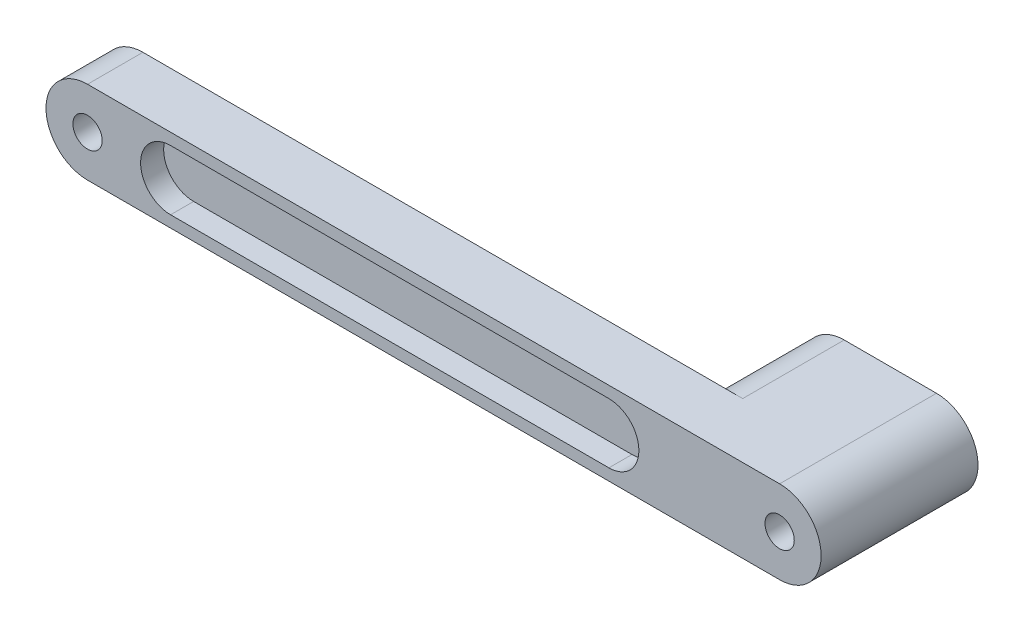
ISO-10303-21;
HEADER;
FILE_DESCRIPTION(('STEP AP214'),'2;1');
FILE_NAME('part.step','',(''),(''),'','','');
FILE_SCHEMA(('AUTOMOTIVE_DESIGN { 1 0 10303 214 1 1 1 1 }'));
ENDSEC;
DATA;
#1=APPLICATION_CONTEXT('core data for automotive mechanical design processes');
#2=APPLICATION_PROTOCOL_DEFINITION('international standard','automotive_design',2000,#1);
#3=PRODUCT_CONTEXT('',#1,'mechanical');
#4=PRODUCT('Part','Part','',(#3));
#5=PRODUCT_RELATED_PRODUCT_CATEGORY('part','',(#4));
#6=PRODUCT_DEFINITION_FORMATION('','',#4);
#7=PRODUCT_DEFINITION_CONTEXT('part definition',#1,'design');
#8=PRODUCT_DEFINITION('design','',#6,#7);
#9=PRODUCT_DEFINITION_SHAPE('','',#8);
#10=(LENGTH_UNIT() NAMED_UNIT(*) SI_UNIT(.MILLI.,.METRE.));
#11=(NAMED_UNIT(*) PLANE_ANGLE_UNIT() SI_UNIT($,.RADIAN.));
#12=(NAMED_UNIT(*) SI_UNIT($,.STERADIAN.) SOLID_ANGLE_UNIT());
#13=UNCERTAINTY_MEASURE_WITH_UNIT(LENGTH_MEASURE(1.E-05),#10,'distance_accuracy_value','');
#14=(GEOMETRIC_REPRESENTATION_CONTEXT(3) GLOBAL_UNCERTAINTY_ASSIGNED_CONTEXT((#13)) GLOBAL_UNIT_ASSIGNED_CONTEXT((#10,
#11,#12)) REPRESENTATION_CONTEXT('',''));
#15=CARTESIAN_POINT('',(0.,0.,0.));
#16=DIRECTION('',(0.,0.,1.));
#17=DIRECTION('',(1.,0.,0.));
#18=AXIS2_PLACEMENT_3D('',#15,#16,#17);
#19=CARTESIAN_POINT('',(0.,0.,0.));
#20=DIRECTION('',(0.,0.,1.));
#21=DIRECTION('',(1.,0.,0.));
#22=AXIS2_PLACEMENT_3D('',#19,#20,#21);
#23=PLANE('',#22);
#24=CARTESIAN_POINT('',(0.,0.,0.));
#25=DIRECTION('',(0.,0.,1.));
#26=DIRECTION('',(1.,0.,0.));
#27=AXIS2_PLACEMENT_3D('',#24,#25,#26);
#28=CIRCLE('',#27,3.175);
#29=CARTESIAN_POINT('',(3.175,0.,0.));
#30=VERTEX_POINT('',#29);
#31=EDGE_CURVE('E281',#30,#30,#28,.T.);
#32=ORIENTED_EDGE('',*,*,#31,.T.);
#33=EDGE_LOOP('',(#32));
#34=FACE_BOUND('',#33,.T.);
#35=CARTESIAN_POINT('',(130.,0.,0.));
#36=DIRECTION('',(0.,0.,-1.));
#37=DIRECTION('',(-1.,0.,0.));
#38=AXIS2_PLACEMENT_3D('',#35,#36,#37);
#39=CIRCLE('',#38,9.);
#40=CARTESIAN_POINT('',(130.,-9.,0.));
#41=VERTEX_POINT('',#40);
#42=CARTESIAN_POINT('',(130.,9.,0.));
#43=VERTEX_POINT('',#42);
#44=EDGE_CURVE('E259',#41,#43,#39,.T.);
#45=ORIENTED_EDGE('',*,*,#44,.F.);
#46=DIRECTION('',(1.,0.,0.));
#47=VECTOR('',#46,1.);
#48=CARTESIAN_POINT('',(0.,-9.,0.));
#49=LINE('',#48,#47);
#50=CARTESIAN_POINT('',(0.,-9.,0.));
#51=VERTEX_POINT('',#50);
#52=EDGE_CURVE('E301',#51,#41,#49,.T.);
#53=ORIENTED_EDGE('',*,*,#52,.F.);
#54=CARTESIAN_POINT('',(0.,0.,0.));
#55=DIRECTION('',(0.,0.,1.));
#56=DIRECTION('',(1.,0.,0.));
#57=AXIS2_PLACEMENT_3D('',#54,#55,#56);
#58=CIRCLE('',#57,9.);
#59=CARTESIAN_POINT('',(0.,9.,0.));
#60=VERTEX_POINT('',#59);
#61=EDGE_CURVE('E285',#60,#51,#58,.T.);
#62=ORIENTED_EDGE('',*,*,#61,.F.);
#63=DIRECTION('',(-1.,0.,0.));
#64=VECTOR('',#63,1.);
#65=CARTESIAN_POINT('',(0.,9.,0.));
#66=LINE('',#65,#64);
#67=EDGE_CURVE('E292',#43,#60,#66,.T.);
#68=ORIENTED_EDGE('',*,*,#67,.F.);
#69=EDGE_LOOP('',(#45,#53,#62,#68));
#70=FACE_BOUND('',#69,.T.);
#71=CARTESIAN_POINT('',(18.,0.,0.));
#72=DIRECTION('',(0.,0.,1.));
#73=DIRECTION('',(1.,0.,0.));
#74=AXIS2_PLACEMENT_3D('',#71,#72,#73);
#75=CIRCLE('',#74,6.5);
#76=CARTESIAN_POINT('',(18.,6.5,0.));
#77=VERTEX_POINT('',#76);
#78=CARTESIAN_POINT('',(18.,-6.5,0.));
#79=VERTEX_POINT('',#78);
#80=EDGE_CURVE('E55',#77,#79,#75,.T.);
#81=ORIENTED_EDGE('',*,*,#80,.T.);
#82=DIRECTION('',(1.,0.,0.));
#83=VECTOR('',#82,1.);
#84=CARTESIAN_POINT('',(18.,-6.5,0.));
#85=LINE('',#84,#83);
#86=CARTESIAN_POINT('',(113.,-6.50000000000001,0.));
#87=VERTEX_POINT('',#86);
#88=EDGE_CURVE('E201',#79,#87,#85,.T.);
#89=ORIENTED_EDGE('',*,*,#88,.T.);
#90=CARTESIAN_POINT('',(113.,0.,0.));
#91=DIRECTION('',(0.,0.,1.));
#92=DIRECTION('',(1.,0.,0.));
#93=AXIS2_PLACEMENT_3D('',#90,#91,#92);
#94=CIRCLE('',#93,6.50000000000001);
#95=CARTESIAN_POINT('',(113.,6.50000000000001,0.));
#96=VERTEX_POINT('',#95);
#97=EDGE_CURVE('E212',#87,#96,#94,.T.);
#98=ORIENTED_EDGE('',*,*,#97,.T.);
#99=DIRECTION('',(-1.,0.,0.));
#100=VECTOR('',#99,1.);
#101=CARTESIAN_POINT('',(18.,6.5,0.));
#102=LINE('',#101,#100);
#103=EDGE_CURVE('E209',#96,#77,#102,.T.);
#104=ORIENTED_EDGE('',*,*,#103,.T.);
#105=EDGE_LOOP('',(#81,#89,#98,#104));
#106=FACE_BOUND('',#105,.T.);
#107=ADVANCED_FACE('F32',(#34,#70,#106),#23,.F.);
#108=CARTESIAN_POINT('',(0.,0.,12.));
#109=DIRECTION('',(0.,0.,1.));
#110=DIRECTION('',(1.,0.,0.));
#111=AXIS2_PLACEMENT_3D('',#108,#109,#110);
#112=PLANE('',#111);
#113=CARTESIAN_POINT('',(18.,0.,12.));
#114=DIRECTION('',(0.,0.,1.));
#115=DIRECTION('',(1.,0.,0.));
#116=AXIS2_PLACEMENT_3D('',#113,#114,#115);
#117=CIRCLE('',#116,6.5);
#118=CARTESIAN_POINT('',(18.,6.5,12.));
#119=VERTEX_POINT('',#118);
#120=CARTESIAN_POINT('',(18.,-6.5,12.));
#121=VERTEX_POINT('',#120);
#122=EDGE_CURVE('E219',#119,#121,#117,.T.);
#123=ORIENTED_EDGE('',*,*,#122,.F.);
#124=DIRECTION('',(-1.,0.,0.));
#125=VECTOR('',#124,1.);
#126=CARTESIAN_POINT('',(18.,6.5,12.));
#127=LINE('',#126,#125);
#128=CARTESIAN_POINT('',(113.,6.50000000000001,12.));
#129=VERTEX_POINT('',#128);
#130=EDGE_CURVE('E229',#129,#119,#127,.T.);
#131=ORIENTED_EDGE('',*,*,#130,.F.);
#132=CARTESIAN_POINT('',(113.,0.,12.));
#133=DIRECTION('',(0.,0.,1.));
#134=DIRECTION('',(1.,0.,0.));
#135=AXIS2_PLACEMENT_3D('',#132,#133,#134);
#136=CIRCLE('',#135,6.50000000000001);
#137=CARTESIAN_POINT('',(113.,-6.50000000000001,12.));
#138=VERTEX_POINT('',#137);
#139=EDGE_CURVE('E243',#138,#129,#136,.T.);
#140=ORIENTED_EDGE('',*,*,#139,.F.);
#141=DIRECTION('',(1.,0.,0.));
#142=VECTOR('',#141,1.);
#143=CARTESIAN_POINT('',(18.,-6.5,12.));
#144=LINE('',#143,#142);
#145=EDGE_CURVE('E240',#121,#138,#144,.T.);
#146=ORIENTED_EDGE('',*,*,#145,.F.);
#147=EDGE_LOOP('',(#123,#131,#140,#146));
#148=FACE_BOUND('',#147,.T.);
#149=CARTESIAN_POINT('',(0.,0.,12.));
#150=DIRECTION('',(0.,0.,1.));
#151=DIRECTION('',(1.,0.,0.));
#152=AXIS2_PLACEMENT_3D('',#149,#150,#151);
#153=CIRCLE('',#152,3.175);
#154=CARTESIAN_POINT('',(3.175,0.,12.));
#155=VERTEX_POINT('',#154);
#156=EDGE_CURVE('E282',#155,#155,#153,.T.);
#157=ORIENTED_EDGE('',*,*,#156,.F.);
#158=EDGE_LOOP('',(#157));
#159=FACE_BOUND('',#158,.T.);
#160=CARTESIAN_POINT('',(0.,0.,12.));
#161=DIRECTION('',(0.,0.,1.));
#162=DIRECTION('',(1.,0.,0.));
#163=AXIS2_PLACEMENT_3D('',#160,#161,#162);
#164=CIRCLE('',#163,9.);
#165=CARTESIAN_POINT('',(0.,9.,12.));
#166=VERTEX_POINT('',#165);
#167=CARTESIAN_POINT('',(0.,-9.,12.));
#168=VERTEX_POINT('',#167);
#169=EDGE_CURVE('E288',#166,#168,#164,.T.);
#170=ORIENTED_EDGE('',*,*,#169,.T.);
#171=DIRECTION('',(1.,0.,0.));
#172=VECTOR('',#171,1.);
#173=CARTESIAN_POINT('',(0.,-9.,12.));
#174=LINE('',#173,#172);
#175=CARTESIAN_POINT('',(150.,-9.,12.));
#176=VERTEX_POINT('',#175);
#177=EDGE_CURVE('E291',#168,#176,#174,.T.);
#178=ORIENTED_EDGE('',*,*,#177,.T.);
#179=CARTESIAN_POINT('',(150.,0.,12.));
#180=DIRECTION('',(0.,0.,1.));
#181=DIRECTION('',(1.,0.,0.));
#182=AXIS2_PLACEMENT_3D('',#179,#180,#181);
#183=CIRCLE('',#182,9.);
#184=CARTESIAN_POINT('',(150.,9.,12.));
#185=VERTEX_POINT('',#184);
#186=EDGE_CURVE('E294',#176,#185,#183,.T.);
#187=ORIENTED_EDGE('',*,*,#186,.T.);
#188=DIRECTION('',(-1.,0.,0.));
#189=VECTOR('',#188,1.);
#190=CARTESIAN_POINT('',(0.,9.,12.));
#191=LINE('',#190,#189);
#192=EDGE_CURVE('E296',#185,#166,#191,.T.);
#193=ORIENTED_EDGE('',*,*,#192,.T.);
#194=EDGE_LOOP('',(#170,#178,#187,#193));
#195=FACE_BOUND('',#194,.T.);
#196=CARTESIAN_POINT('',(150.,0.,12.));
#197=DIRECTION('',(0.,0.,1.));
#198=DIRECTION('',(1.,0.,0.));
#199=AXIS2_PLACEMENT_3D('',#196,#197,#198);
#200=CIRCLE('',#199,3.175);
#201=CARTESIAN_POINT('',(153.175,0.,12.));
#202=VERTEX_POINT('',#201);
#203=EDGE_CURVE('E278',#202,#202,#200,.T.);
#204=ORIENTED_EDGE('',*,*,#203,.F.);
#205=EDGE_LOOP('',(#204));
#206=FACE_BOUND('',#205,.T.);
#207=ADVANCED_FACE('F330',(#148,#159,#195,#206),#112,.T.);
#208=CARTESIAN_POINT('',(0.,0.,12.));
#209=DIRECTION('',(0.,0.,-1.));
#210=DIRECTION('',(-1.,0.,0.));
#211=AXIS2_PLACEMENT_3D('',#208,#209,#210);
#212=CYLINDRICAL_SURFACE('',#211,9.);
#213=ORIENTED_EDGE('',*,*,#61,.T.);
#214=DIRECTION('',(0.,0.,-1.));
#215=VECTOR('',#214,1.);
#216=CARTESIAN_POINT('',(0.,-9.,12.));
#217=LINE('',#216,#215);
#218=EDGE_CURVE('E11',#168,#51,#217,.T.);
#219=ORIENTED_EDGE('',*,*,#218,.F.);
#220=ORIENTED_EDGE('',*,*,#169,.F.);
#221=DIRECTION('',(0.,0.,-1.));
#222=VECTOR('',#221,1.);
#223=CARTESIAN_POINT('',(0.,9.,12.));
#224=LINE('',#223,#222);
#225=EDGE_CURVE('E298',#166,#60,#224,.T.);
#226=ORIENTED_EDGE('',*,*,#225,.T.);
#227=EDGE_LOOP('',(#213,#219,#220,#226));
#228=FACE_BOUND('',#227,.T.);
#229=ADVANCED_FACE('F34',(#228),#212,.T.);
#230=CARTESIAN_POINT('',(0.,-9.,12.));
#231=DIRECTION('',(0.,1.,0.));
#232=DIRECTION('',(0.,0.,1.));
#233=AXIS2_PLACEMENT_3D('',#230,#231,#232);
#234=PLANE('',#233);
#235=ORIENTED_EDGE('',*,*,#52,.T.);
#236=DIRECTION('',(0.,0.,1.));
#237=VECTOR('',#236,1.);
#238=CARTESIAN_POINT('',(130.,-9.,-22.));
#239=LINE('',#238,#237);
#240=CARTESIAN_POINT('',(130.,-9.,-22.));
#241=VERTEX_POINT('',#240);
#242=EDGE_CURVE('E275',#241,#41,#239,.T.);
#243=ORIENTED_EDGE('',*,*,#242,.F.);
#244=DIRECTION('',(-1.,0.,0.));
#245=VECTOR('',#244,1.);
#246=CARTESIAN_POINT('',(150.,-9.,-22.));
#247=LINE('',#246,#245);
#248=CARTESIAN_POINT('',(150.,-9.,-22.));
#249=VERTEX_POINT('',#248);
#250=EDGE_CURVE('E263',#249,#241,#247,.T.);
#251=ORIENTED_EDGE('',*,*,#250,.F.);
#252=DIRECTION('',(0.,0.,-1.));
#253=VECTOR('',#252,1.);
#254=CARTESIAN_POINT('',(150.,-9.,12.));
#255=LINE('',#254,#253);
#256=EDGE_CURVE('E40',#176,#249,#255,.T.);
#257=ORIENTED_EDGE('',*,*,#256,.F.);
#258=ORIENTED_EDGE('',*,*,#177,.F.);
#259=ORIENTED_EDGE('',*,*,#218,.T.);
#260=EDGE_LOOP('',(#235,#243,#251,#257,#258,#259));
#261=FACE_BOUND('',#260,.T.);
#262=ADVANCED_FACE('F317',(#261),#234,.F.);
#263=CARTESIAN_POINT('',(150.,0.,12.));
#264=DIRECTION('',(0.,0.,-1.));
#265=DIRECTION('',(-1.,0.,0.));
#266=AXIS2_PLACEMENT_3D('',#263,#264,#265);
#267=CYLINDRICAL_SURFACE('',#266,9.);
#268=ORIENTED_EDGE('',*,*,#256,.T.);
#269=CARTESIAN_POINT('',(150.,0.,-22.));
#270=DIRECTION('',(0.,0.,-1.));
#271=DIRECTION('',(-1.,0.,0.));
#272=AXIS2_PLACEMENT_3D('',#269,#270,#271);
#273=CIRCLE('',#272,9.);
#274=CARTESIAN_POINT('',(150.,9.,-22.));
#275=VERTEX_POINT('',#274);
#276=EDGE_CURVE('E260',#275,#249,#273,.T.);
#277=ORIENTED_EDGE('',*,*,#276,.F.);
#278=DIRECTION('',(0.,0.,-1.));
#279=VECTOR('',#278,1.);
#280=CARTESIAN_POINT('',(150.,9.,12.));
#281=LINE('',#280,#279);
#282=EDGE_CURVE('E307',#185,#275,#281,.T.);
#283=ORIENTED_EDGE('',*,*,#282,.F.);
#284=ORIENTED_EDGE('',*,*,#186,.F.);
#285=EDGE_LOOP('',(#268,#277,#283,#284));
#286=FACE_BOUND('',#285,.T.);
#287=ADVANCED_FACE('F313',(#286),#267,.T.);
#288=CARTESIAN_POINT('',(0.,9.,12.));
#289=DIRECTION('',(0.,-1.,0.));
#290=DIRECTION('',(0.,0.,-1.));
#291=AXIS2_PLACEMENT_3D('',#288,#289,#290);
#292=PLANE('',#291);
#293=ORIENTED_EDGE('',*,*,#282,.T.);
#294=DIRECTION('',(1.,0.,0.));
#295=VECTOR('',#294,1.);
#296=CARTESIAN_POINT('',(150.,9.,-22.));
#297=LINE('',#296,#295);
#298=CARTESIAN_POINT('',(130.,9.,-22.));
#299=VERTEX_POINT('',#298);
#300=EDGE_CURVE('E267',#299,#275,#297,.T.);
#301=ORIENTED_EDGE('',*,*,#300,.F.);
#302=DIRECTION('',(0.,0.,1.));
#303=VECTOR('',#302,1.);
#304=CARTESIAN_POINT('',(130.,9.,-22.));
#305=LINE('',#304,#303);
#306=EDGE_CURVE('E270',#299,#43,#305,.T.);
#307=ORIENTED_EDGE('',*,*,#306,.T.);
#308=ORIENTED_EDGE('',*,*,#67,.T.);
#309=ORIENTED_EDGE('',*,*,#225,.F.);
#310=ORIENTED_EDGE('',*,*,#192,.F.);
#311=EDGE_LOOP('',(#293,#301,#307,#308,#309,#310));
#312=FACE_BOUND('',#311,.T.);
#313=ADVANCED_FACE('F325',(#312),#292,.F.);
#314=CARTESIAN_POINT('',(0.,0.,12.));
#315=DIRECTION('',(0.,0.,-1.));
#316=DIRECTION('',(-1.,0.,0.));
#317=AXIS2_PLACEMENT_3D('',#314,#315,#316);
#318=CYLINDRICAL_SURFACE('',#317,3.175);
#319=ORIENTED_EDGE('',*,*,#156,.T.);
#320=EDGE_LOOP('',(#319));
#321=FACE_BOUND('',#320,.T.);
#322=ORIENTED_EDGE('',*,*,#31,.F.);
#323=EDGE_LOOP('',(#322));
#324=FACE_BOUND('',#323,.T.);
#325=ADVANCED_FACE('F365',(#321,#324),#318,.F.);
#326=CARTESIAN_POINT('',(150.,0.,12.));
#327=DIRECTION('',(0.,0.,-1.));
#328=DIRECTION('',(-1.,0.,0.));
#329=AXIS2_PLACEMENT_3D('',#326,#327,#328);
#330=CYLINDRICAL_SURFACE('',#329,3.175);
#331=ORIENTED_EDGE('',*,*,#203,.T.);
#332=EDGE_LOOP('',(#331));
#333=FACE_BOUND('',#332,.T.);
#334=CARTESIAN_POINT('',(150.,0.,-22.));
#335=DIRECTION('',(0.,0.,-1.));
#336=DIRECTION('',(-1.,0.,0.));
#337=AXIS2_PLACEMENT_3D('',#334,#335,#336);
#338=CIRCLE('',#337,3.175);
#339=CARTESIAN_POINT('',(146.825,0.,-22.));
#340=VERTEX_POINT('',#339);
#341=EDGE_CURVE('E250',#340,#340,#338,.T.);
#342=ORIENTED_EDGE('',*,*,#341,.T.);
#343=EDGE_LOOP('',(#342));
#344=FACE_BOUND('',#343,.T.);
#345=ADVANCED_FACE('F349',(#333,#344),#330,.F.);
#346=CARTESIAN_POINT('',(150.,0.,-22.));
#347=DIRECTION('',(0.,0.,-1.));
#348=DIRECTION('',(-1.,0.,0.));
#349=AXIS2_PLACEMENT_3D('',#346,#347,#348);
#350=PLANE('',#349);
#351=DIRECTION('',(1.,0.,0.));
#352=VECTOR('',#351,1.);
#353=CARTESIAN_POINT('',(0.,6.00000000000003,-22.));
#354=LINE('',#353,#352);
#355=CARTESIAN_POINT('',(130.,6.,-22.));
#356=VERTEX_POINT('',#355);
#357=CARTESIAN_POINT('',(138.,6.,-22.));
#358=VERTEX_POINT('',#357);
#359=EDGE_CURVE('E47',#356,#358,#354,.T.);
#360=ORIENTED_EDGE('',*,*,#359,.F.);
#361=CARTESIAN_POINT('',(130.,0.,-22.));
#362=DIRECTION('',(0.,0.,-1.));
#363=DIRECTION('',(-1.,0.,0.));
#364=AXIS2_PLACEMENT_3D('',#361,#362,#363);
#365=CIRCLE('',#364,6.);
#366=CARTESIAN_POINT('',(130.,-6.,-22.));
#367=VERTEX_POINT('',#366);
#368=EDGE_CURVE('E179',#367,#356,#365,.T.);
#369=ORIENTED_EDGE('',*,*,#368,.F.);
#370=DIRECTION('',(-1.,0.,0.));
#371=VECTOR('',#370,1.);
#372=CARTESIAN_POINT('',(0.,-6.00000000000004,-22.));
#373=LINE('',#372,#371);
#374=CARTESIAN_POINT('',(138.,-6.,-22.));
#375=VERTEX_POINT('',#374);
#376=EDGE_CURVE('E182',#375,#367,#373,.T.);
#377=ORIENTED_EDGE('',*,*,#376,.F.);
#378=CARTESIAN_POINT('',(138.,0.,-22.));
#379=DIRECTION('',(0.,0.,-1.));
#380=DIRECTION('',(-1.,0.,0.));
#381=AXIS2_PLACEMENT_3D('',#378,#379,#380);
#382=CIRCLE('',#381,6.);
#383=EDGE_CURVE('E188',#358,#375,#382,.T.);
#384=ORIENTED_EDGE('',*,*,#383,.F.);
#385=EDGE_LOOP('',(#360,#369,#377,#384));
#386=FACE_BOUND('',#385,.T.);
#387=ORIENTED_EDGE('',*,*,#276,.T.);
#388=ORIENTED_EDGE('',*,*,#250,.T.);
#389=CARTESIAN_POINT('',(130.,0.,-22.));
#390=DIRECTION('',(0.,0.,-1.));
#391=DIRECTION('',(-1.,0.,0.));
#392=AXIS2_PLACEMENT_3D('',#389,#390,#391);
#393=CIRCLE('',#392,9.);
#394=EDGE_CURVE('E265',#241,#299,#393,.T.);
#395=ORIENTED_EDGE('',*,*,#394,.T.);
#396=ORIENTED_EDGE('',*,*,#300,.T.);
#397=EDGE_LOOP('',(#387,#388,#395,#396));
#398=FACE_BOUND('',#397,.T.);
#399=ORIENTED_EDGE('',*,*,#341,.F.);
#400=EDGE_LOOP('',(#399));
#401=FACE_BOUND('',#400,.T.);
#402=ADVANCED_FACE('F320',(#386,#398,#401),#350,.T.);
#403=CARTESIAN_POINT('',(130.,0.,-22.));
#404=DIRECTION('',(0.,0.,1.));
#405=DIRECTION('',(1.,0.,0.));
#406=AXIS2_PLACEMENT_3D('',#403,#404,#405);
#407=CYLINDRICAL_SURFACE('',#406,9.);
#408=ORIENTED_EDGE('',*,*,#44,.T.);
#409=ORIENTED_EDGE('',*,*,#306,.F.);
#410=ORIENTED_EDGE('',*,*,#394,.F.);
#411=ORIENTED_EDGE('',*,*,#242,.T.);
#412=EDGE_LOOP('',(#408,#409,#410,#411));
#413=FACE_BOUND('',#412,.T.);
#414=ADVANCED_FACE('F338',(#413),#407,.T.);
#415=CARTESIAN_POINT('',(18.,0.,7.));
#416=DIRECTION('',(0.,0.,1.));
#417=DIRECTION('',(1.,0.,0.));
#418=AXIS2_PLACEMENT_3D('',#415,#416,#417);
#419=CYLINDRICAL_SURFACE('',#418,6.5);
#420=ORIENTED_EDGE('',*,*,#122,.T.);
#421=DIRECTION('',(0.,0.,1.));
#422=VECTOR('',#421,1.);
#423=CARTESIAN_POINT('',(18.,-6.5,7.));
#424=LINE('',#423,#422);
#425=CARTESIAN_POINT('',(18.,-6.5,7.));
#426=VERTEX_POINT('',#425);
#427=EDGE_CURVE('E238',#426,#121,#424,.T.);
#428=ORIENTED_EDGE('',*,*,#427,.F.);
#429=CARTESIAN_POINT('',(18.,0.,7.));
#430=DIRECTION('',(0.,0.,1.));
#431=DIRECTION('',(1.,0.,0.));
#432=AXIS2_PLACEMENT_3D('',#429,#430,#431);
#433=CIRCLE('',#432,6.5);
#434=CARTESIAN_POINT('',(18.,6.5,7.));
#435=VERTEX_POINT('',#434);
#436=EDGE_CURVE('E225',#435,#426,#433,.T.);
#437=ORIENTED_EDGE('',*,*,#436,.F.);
#438=DIRECTION('',(0.,0.,1.));
#439=VECTOR('',#438,1.);
#440=CARTESIAN_POINT('',(18.,6.5,7.));
#441=LINE('',#440,#439);
#442=EDGE_CURVE('E248',#435,#119,#441,.T.);
#443=ORIENTED_EDGE('',*,*,#442,.T.);
#444=EDGE_LOOP('',(#420,#428,#437,#443));
#445=FACE_BOUND('',#444,.T.);
#446=ADVANCED_FACE('F340',(#445),#419,.F.);
#447=CARTESIAN_POINT('',(18.,6.5,7.));
#448=DIRECTION('',(0.,1.,0.));
#449=DIRECTION('',(-1.,0.,0.));
#450=AXIS2_PLACEMENT_3D('',#447,#448,#449);
#451=PLANE('',#450);
#452=ORIENTED_EDGE('',*,*,#130,.T.);
#453=ORIENTED_EDGE('',*,*,#442,.F.);
#454=DIRECTION('',(-1.,0.,0.));
#455=VECTOR('',#454,1.);
#456=CARTESIAN_POINT('',(18.,6.5,7.));
#457=LINE('',#456,#455);
#458=CARTESIAN_POINT('',(113.,6.50000000000001,7.));
#459=VERTEX_POINT('',#458);
#460=EDGE_CURVE('E235',#459,#435,#457,.T.);
#461=ORIENTED_EDGE('',*,*,#460,.F.);
#462=DIRECTION('',(0.,0.,1.));
#463=VECTOR('',#462,1.);
#464=CARTESIAN_POINT('',(113.,6.50000000000001,7.));
#465=LINE('',#464,#463);
#466=EDGE_CURVE('E251',#459,#129,#465,.T.);
#467=ORIENTED_EDGE('',*,*,#466,.T.);
#468=EDGE_LOOP('',(#452,#453,#461,#467));
#469=FACE_BOUND('',#468,.T.);
#470=ADVANCED_FACE('F346',(#469),#451,.F.);
#471=CARTESIAN_POINT('',(113.,0.,7.));
#472=DIRECTION('',(0.,0.,1.));
#473=DIRECTION('',(1.,0.,0.));
#474=AXIS2_PLACEMENT_3D('',#471,#472,#473);
#475=CYLINDRICAL_SURFACE('',#474,6.50000000000001);
#476=ORIENTED_EDGE('',*,*,#139,.T.);
#477=ORIENTED_EDGE('',*,*,#466,.F.);
#478=CARTESIAN_POINT('',(113.,0.,7.));
#479=DIRECTION('',(0.,0.,1.));
#480=DIRECTION('',(1.,0.,0.));
#481=AXIS2_PLACEMENT_3D('',#478,#479,#480);
#482=CIRCLE('',#481,6.50000000000001);
#483=CARTESIAN_POINT('',(113.,-6.50000000000001,7.));
#484=VERTEX_POINT('',#483);
#485=EDGE_CURVE('E232',#484,#459,#482,.T.);
#486=ORIENTED_EDGE('',*,*,#485,.F.);
#487=DIRECTION('',(0.,0.,1.));
#488=VECTOR('',#487,1.);
#489=CARTESIAN_POINT('',(113.,-6.50000000000001,7.));
#490=LINE('',#489,#488);
#491=EDGE_CURVE('E253',#484,#138,#490,.T.);
#492=ORIENTED_EDGE('',*,*,#491,.T.);
#493=EDGE_LOOP('',(#476,#477,#486,#492));
#494=FACE_BOUND('',#493,.T.);
#495=ADVANCED_FACE('F396',(#494),#475,.F.);
#496=CARTESIAN_POINT('',(18.,-6.5,7.));
#497=DIRECTION('',(0.,-1.,0.));
#498=DIRECTION('',(1.,0.,0.));
#499=AXIS2_PLACEMENT_3D('',#496,#497,#498);
#500=PLANE('',#499);
#501=ORIENTED_EDGE('',*,*,#145,.T.);
#502=ORIENTED_EDGE('',*,*,#491,.F.);
#503=DIRECTION('',(1.,0.,0.));
#504=VECTOR('',#503,1.);
#505=CARTESIAN_POINT('',(18.,-6.5,7.));
#506=LINE('',#505,#504);
#507=EDGE_CURVE('E228',#426,#484,#506,.T.);
#508=ORIENTED_EDGE('',*,*,#507,.F.);
#509=ORIENTED_EDGE('',*,*,#427,.T.);
#510=EDGE_LOOP('',(#501,#502,#508,#509));
#511=FACE_BOUND('',#510,.T.);
#512=ADVANCED_FACE('F406',(#511),#500,.F.);
#513=CARTESIAN_POINT('',(18.,0.,7.));
#514=DIRECTION('',(0.,0.,1.));
#515=DIRECTION('',(1.,0.,0.));
#516=AXIS2_PLACEMENT_3D('',#513,#514,#515);
#517=PLANE('',#516);
#518=ORIENTED_EDGE('',*,*,#436,.T.);
#519=ORIENTED_EDGE('',*,*,#507,.T.);
#520=ORIENTED_EDGE('',*,*,#485,.T.);
#521=ORIENTED_EDGE('',*,*,#460,.T.);
#522=EDGE_LOOP('',(#518,#519,#520,#521));
#523=FACE_BOUND('',#522,.T.);
#524=ADVANCED_FACE('F416',(#523),#517,.T.);
#525=CARTESIAN_POINT('',(18.,0.,5.));
#526=DIRECTION('',(0.,0.,-1.));
#527=DIRECTION('',(-1.,0.,0.));
#528=AXIS2_PLACEMENT_3D('',#525,#526,#527);
#529=CYLINDRICAL_SURFACE('',#528,6.5);
#530=ORIENTED_EDGE('',*,*,#80,.F.);
#531=DIRECTION('',(0.,0.,-1.));
#532=VECTOR('',#531,1.);
#533=CARTESIAN_POINT('',(18.,6.5,5.));
#534=LINE('',#533,#532);
#535=CARTESIAN_POINT('',(18.,6.5,5.));
#536=VERTEX_POINT('',#535);
#537=EDGE_CURVE('E207',#536,#77,#534,.T.);
#538=ORIENTED_EDGE('',*,*,#537,.F.);
#539=CARTESIAN_POINT('',(18.,0.,5.));
#540=DIRECTION('',(0.,0.,1.));
#541=DIRECTION('',(1.,0.,0.));
#542=AXIS2_PLACEMENT_3D('',#539,#540,#541);
#543=CIRCLE('',#542,6.5);
#544=CARTESIAN_POINT('',(18.,-6.5,5.));
#545=VERTEX_POINT('',#544);
#546=EDGE_CURVE('E197',#536,#545,#543,.T.);
#547=ORIENTED_EDGE('',*,*,#546,.T.);
#548=DIRECTION('',(0.,0.,-1.));
#549=VECTOR('',#548,1.);
#550=CARTESIAN_POINT('',(18.,-6.5,5.));
#551=LINE('',#550,#549);
#552=EDGE_CURVE('E217',#545,#79,#551,.T.);
#553=ORIENTED_EDGE('',*,*,#552,.T.);
#554=EDGE_LOOP('',(#530,#538,#547,#553));
#555=FACE_BOUND('',#554,.T.);
#556=ADVANCED_FACE('F425',(#555),#529,.F.);
#557=CARTESIAN_POINT('',(18.,-6.5,5.));
#558=DIRECTION('',(0.,1.,0.));
#559=DIRECTION('',(-1.,0.,0.));
#560=AXIS2_PLACEMENT_3D('',#557,#558,#559);
#561=PLANE('',#560);
#562=ORIENTED_EDGE('',*,*,#88,.F.);
#563=ORIENTED_EDGE('',*,*,#552,.F.);
#564=DIRECTION('',(1.,0.,0.));
#565=VECTOR('',#564,1.);
#566=CARTESIAN_POINT('',(18.,-6.5,5.));
#567=LINE('',#566,#565);
#568=CARTESIAN_POINT('',(113.,-6.50000000000001,5.));
#569=VERTEX_POINT('',#568);
#570=EDGE_CURVE('E205',#545,#569,#567,.T.);
#571=ORIENTED_EDGE('',*,*,#570,.T.);
#572=DIRECTION('',(0.,0.,-1.));
#573=VECTOR('',#572,1.);
#574=CARTESIAN_POINT('',(113.,-6.50000000000001,5.));
#575=LINE('',#574,#573);
#576=EDGE_CURVE('E220',#569,#87,#575,.T.);
#577=ORIENTED_EDGE('',*,*,#576,.T.);
#578=EDGE_LOOP('',(#562,#563,#571,#577));
#579=FACE_BOUND('',#578,.T.);
#580=ADVANCED_FACE('F440',(#579),#561,.T.);
#581=CARTESIAN_POINT('',(113.,0.,5.));
#582=DIRECTION('',(0.,0.,-1.));
#583=DIRECTION('',(-1.,0.,0.));
#584=AXIS2_PLACEMENT_3D('',#581,#582,#583);
#585=CYLINDRICAL_SURFACE('',#584,6.50000000000001);
#586=ORIENTED_EDGE('',*,*,#97,.F.);
#587=ORIENTED_EDGE('',*,*,#576,.F.);
#588=CARTESIAN_POINT('',(113.,0.,5.));
#589=DIRECTION('',(0.,0.,1.));
#590=DIRECTION('',(1.,0.,0.));
#591=AXIS2_PLACEMENT_3D('',#588,#589,#590);
#592=CIRCLE('',#591,6.50000000000001);
#593=CARTESIAN_POINT('',(113.,6.50000000000001,5.));
#594=VERTEX_POINT('',#593);
#595=EDGE_CURVE('E203',#569,#594,#592,.T.);
#596=ORIENTED_EDGE('',*,*,#595,.T.);
#597=DIRECTION('',(0.,0.,-1.));
#598=VECTOR('',#597,1.);
#599=CARTESIAN_POINT('',(113.,6.50000000000001,5.));
#600=LINE('',#599,#598);
#601=EDGE_CURVE('E222',#594,#96,#600,.T.);
#602=ORIENTED_EDGE('',*,*,#601,.T.);
#603=EDGE_LOOP('',(#586,#587,#596,#602));
#604=FACE_BOUND('',#603,.T.);
#605=ADVANCED_FACE('F449',(#604),#585,.F.);
#606=CARTESIAN_POINT('',(18.,6.5,5.));
#607=DIRECTION('',(0.,-1.,0.));
#608=DIRECTION('',(1.,0.,0.));
#609=AXIS2_PLACEMENT_3D('',#606,#607,#608);
#610=PLANE('',#609);
#611=ORIENTED_EDGE('',*,*,#103,.F.);
#612=ORIENTED_EDGE('',*,*,#601,.F.);
#613=DIRECTION('',(-1.,0.,0.));
#614=VECTOR('',#613,1.);
#615=CARTESIAN_POINT('',(18.,6.5,5.));
#616=LINE('',#615,#614);
#617=EDGE_CURVE('E200',#594,#536,#616,.T.);
#618=ORIENTED_EDGE('',*,*,#617,.T.);
#619=ORIENTED_EDGE('',*,*,#537,.T.);
#620=EDGE_LOOP('',(#611,#612,#618,#619));
#621=FACE_BOUND('',#620,.T.);
#622=ADVANCED_FACE('F459',(#621),#610,.T.);
#623=CARTESIAN_POINT('',(18.,0.,5.));
#624=DIRECTION('',(0.,0.,-1.));
#625=DIRECTION('',(1.,0.,0.));
#626=AXIS2_PLACEMENT_3D('',#623,#624,#625);
#627=PLANE('',#626);
#628=ORIENTED_EDGE('',*,*,#546,.F.);
#629=ORIENTED_EDGE('',*,*,#617,.F.);
#630=ORIENTED_EDGE('',*,*,#595,.F.);
#631=ORIENTED_EDGE('',*,*,#570,.F.);
#632=EDGE_LOOP('',(#628,#629,#630,#631));
#633=FACE_BOUND('',#632,.T.);
#634=ADVANCED_FACE('F469',(#633),#627,.T.);
#635=CARTESIAN_POINT('',(0.,6.00000000000003,8.));
#636=DIRECTION('',(0.,1.,0.));
#637=DIRECTION('',(-1.,0.,0.));
#638=AXIS2_PLACEMENT_3D('',#635,#636,#637);
#639=PLANE('',#638);
#640=ORIENTED_EDGE('',*,*,#359,.T.);
#641=DIRECTION('',(0.,0.,-1.));
#642=VECTOR('',#641,1.);
#643=CARTESIAN_POINT('',(138.,6.,8.));
#644=LINE('',#643,#642);
#645=CARTESIAN_POINT('',(138.,6.,8.));
#646=VERTEX_POINT('',#645);
#647=EDGE_CURVE('E157',#646,#358,#644,.T.);
#648=ORIENTED_EDGE('',*,*,#647,.F.);
#649=DIRECTION('',(1.,0.,0.));
#650=VECTOR('',#649,1.);
#651=CARTESIAN_POINT('',(0.,6.00000000000003,8.));
#652=LINE('',#651,#650);
#653=CARTESIAN_POINT('',(130.,6.,8.));
#654=VERTEX_POINT('',#653);
#655=EDGE_CURVE('E161',#654,#646,#652,.T.);
#656=ORIENTED_EDGE('',*,*,#655,.F.);
#657=DIRECTION('',(0.,0.,-1.));
#658=VECTOR('',#657,1.);
#659=CARTESIAN_POINT('',(130.,6.,8.));
#660=LINE('',#659,#658);
#661=EDGE_CURVE('E192',#654,#356,#660,.T.);
#662=ORIENTED_EDGE('',*,*,#661,.T.);
#663=EDGE_LOOP('',(#640,#648,#656,#662));
#664=FACE_BOUND('',#663,.T.);
#665=ADVANCED_FACE('F159',(#664),#639,.F.);
#666=CARTESIAN_POINT('',(130.,0.,8.));
#667=DIRECTION('',(0.,0.,-1.));
#668=DIRECTION('',(-1.,0.,0.));
#669=AXIS2_PLACEMENT_3D('',#666,#667,#668);
#670=CYLINDRICAL_SURFACE('',#669,6.);
#671=ORIENTED_EDGE('',*,*,#368,.T.);
#672=ORIENTED_EDGE('',*,*,#661,.F.);
#673=CARTESIAN_POINT('',(130.,0.,8.));
#674=DIRECTION('',(0.,0.,-1.));
#675=DIRECTION('',(-1.,0.,0.));
#676=AXIS2_PLACEMENT_3D('',#673,#674,#675);
#677=CIRCLE('',#676,6.);
#678=CARTESIAN_POINT('',(130.,-6.,8.));
#679=VERTEX_POINT('',#678);
#680=EDGE_CURVE('E167',#679,#654,#677,.T.);
#681=ORIENTED_EDGE('',*,*,#680,.F.);
#682=DIRECTION('',(0.,0.,-1.));
#683=VECTOR('',#682,1.);
#684=CARTESIAN_POINT('',(130.,-6.,8.));
#685=LINE('',#684,#683);
#686=EDGE_CURVE('E194',#679,#367,#685,.T.);
#687=ORIENTED_EDGE('',*,*,#686,.T.);
#688=EDGE_LOOP('',(#671,#672,#681,#687));
#689=FACE_BOUND('',#688,.T.);
#690=ADVANCED_FACE('F496',(#689),#670,.F.);
#691=CARTESIAN_POINT('',(0.,-6.00000000000004,8.));
#692=DIRECTION('',(0.,-1.,0.));
#693=DIRECTION('',(1.,0.,0.));
#694=AXIS2_PLACEMENT_3D('',#691,#692,#693);
#695=PLANE('',#694);
#696=ORIENTED_EDGE('',*,*,#376,.T.);
#697=ORIENTED_EDGE('',*,*,#686,.F.);
#698=DIRECTION('',(-1.,0.,0.));
#699=VECTOR('',#698,1.);
#700=CARTESIAN_POINT('',(0.,-6.00000000000004,8.));
#701=LINE('',#700,#699);
#702=CARTESIAN_POINT('',(138.,-6.,8.));
#703=VERTEX_POINT('',#702);
#704=EDGE_CURVE('E175',#703,#679,#701,.T.);
#705=ORIENTED_EDGE('',*,*,#704,.F.);
#706=DIRECTION('',(0.,0.,-1.));
#707=VECTOR('',#706,1.);
#708=CARTESIAN_POINT('',(138.,-6.,8.));
#709=LINE('',#708,#707);
#710=EDGE_CURVE('E166',#703,#375,#709,.T.);
#711=ORIENTED_EDGE('',*,*,#710,.T.);
#712=EDGE_LOOP('',(#696,#697,#705,#711));
#713=FACE_BOUND('',#712,.T.);
#714=ADVANCED_FACE('F505',(#713),#695,.F.);
#715=CARTESIAN_POINT('',(138.,0.,8.));
#716=DIRECTION('',(0.,0.,-1.));
#717=DIRECTION('',(-1.,0.,0.));
#718=AXIS2_PLACEMENT_3D('',#715,#716,#717);
#719=CYLINDRICAL_SURFACE('',#718,6.);
#720=ORIENTED_EDGE('',*,*,#383,.T.);
#721=ORIENTED_EDGE('',*,*,#710,.F.);
#722=CARTESIAN_POINT('',(138.,0.,8.));
#723=DIRECTION('',(0.,0.,-1.));
#724=DIRECTION('',(-1.,0.,0.));
#725=AXIS2_PLACEMENT_3D('',#722,#723,#724);
#726=CIRCLE('',#725,6.);
#727=EDGE_CURVE('E170',#646,#703,#726,.T.);
#728=ORIENTED_EDGE('',*,*,#727,.F.);
#729=ORIENTED_EDGE('',*,*,#647,.T.);
#730=EDGE_LOOP('',(#720,#721,#728,#729));
#731=FACE_BOUND('',#730,.T.);
#732=ADVANCED_FACE('F171',(#731),#719,.F.);
#733=CARTESIAN_POINT('',(0.,0.,8.));
#734=DIRECTION('',(0.,0.,-1.));
#735=DIRECTION('',(-1.,0.,0.));
#736=AXIS2_PLACEMENT_3D('',#733,#734,#735);
#737=PLANE('',#736);
#738=ORIENTED_EDGE('',*,*,#655,.T.);
#739=ORIENTED_EDGE('',*,*,#727,.T.);
#740=ORIENTED_EDGE('',*,*,#704,.T.);
#741=ORIENTED_EDGE('',*,*,#680,.T.);
#742=EDGE_LOOP('',(#738,#739,#740,#741));
#743=FACE_BOUND('',#742,.T.);
#744=ADVANCED_FACE('F177',(#743),#737,.T.);
#745=CLOSED_SHELL('',(#107,#207,#229,#262,#287,#313,#325,#345,#402,#414,#446,#470,#495,#512,
#524,#556,#580,#605,#622,#634,#665,#690,#714,#732,#744));
#746=MANIFOLD_SOLID_BREP('B2',#745);
#747=ADVANCED_BREP_SHAPE_REPRESENTATION('',(#18,#746),#14);
#748=SHAPE_DEFINITION_REPRESENTATION(#9,#747);
ENDSEC;
END-ISO-10303-21;
